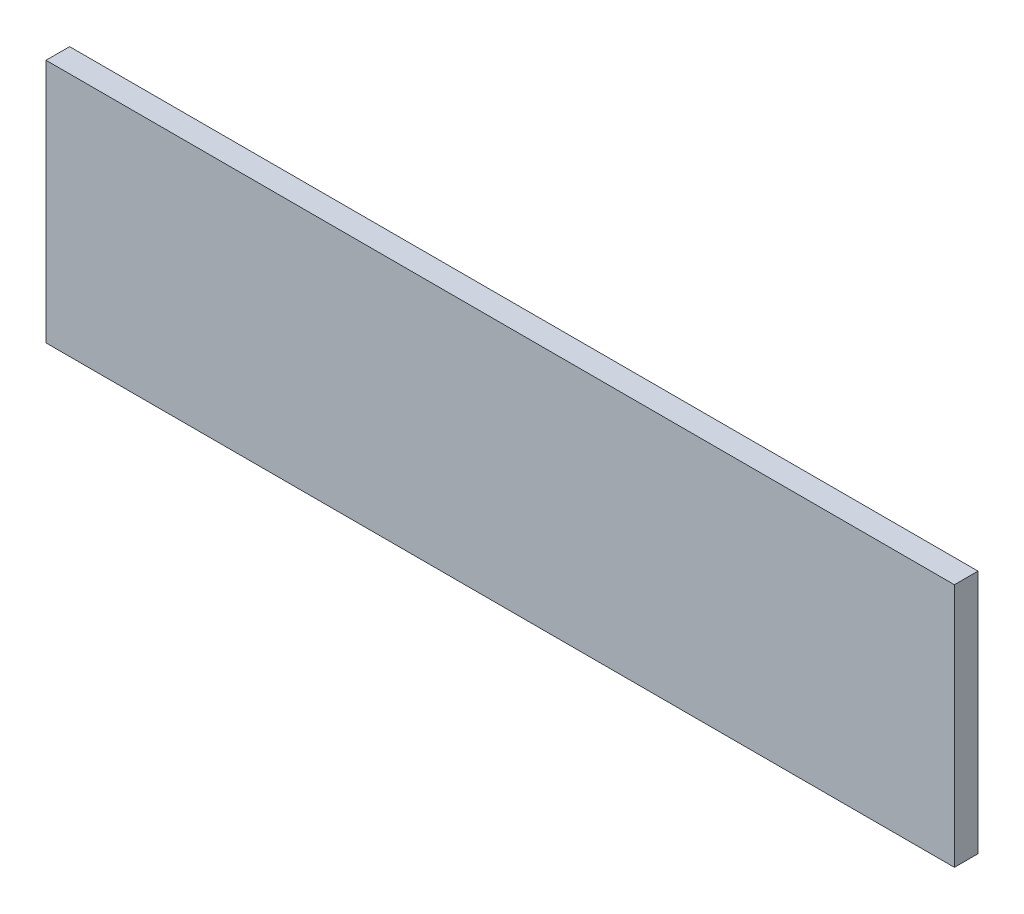
ISO-10303-21;
HEADER;
FILE_DESCRIPTION(('STEP AP214'),'2;1');
FILE_NAME('part.step','',(''),(''),'','','');
FILE_SCHEMA(('AUTOMOTIVE_DESIGN { 1 0 10303 214 1 1 1 1 }'));
ENDSEC;
DATA;
#1=APPLICATION_CONTEXT('core data for automotive mechanical design processes');
#2=APPLICATION_PROTOCOL_DEFINITION('international standard','automotive_design',2000,#1);
#3=PRODUCT_CONTEXT('',#1,'mechanical');
#4=PRODUCT('Part','Part','',(#3));
#5=PRODUCT_RELATED_PRODUCT_CATEGORY('part','',(#4));
#6=PRODUCT_DEFINITION_FORMATION('','',#4);
#7=PRODUCT_DEFINITION_CONTEXT('part definition',#1,'design');
#8=PRODUCT_DEFINITION('design','',#6,#7);
#9=PRODUCT_DEFINITION_SHAPE('','',#8);
#10=(LENGTH_UNIT() NAMED_UNIT(*) SI_UNIT(.MILLI.,.METRE.));
#11=(NAMED_UNIT(*) PLANE_ANGLE_UNIT() SI_UNIT($,.RADIAN.));
#12=(NAMED_UNIT(*) SI_UNIT($,.STERADIAN.) SOLID_ANGLE_UNIT());
#13=UNCERTAINTY_MEASURE_WITH_UNIT(LENGTH_MEASURE(1.E-05),#10,'distance_accuracy_value','');
#14=(GEOMETRIC_REPRESENTATION_CONTEXT(3) GLOBAL_UNCERTAINTY_ASSIGNED_CONTEXT((#13)) GLOBAL_UNIT_ASSIGNED_CONTEXT((#10,
#11,#12)) REPRESENTATION_CONTEXT('',''));
#15=CARTESIAN_POINT('',(0.,0.,0.));
#16=DIRECTION('',(0.,0.,1.));
#17=DIRECTION('',(1.,0.,0.));
#18=AXIS2_PLACEMENT_3D('',#15,#16,#17);
#19=CARTESIAN_POINT('',(0.,0.,-8.));
#20=DIRECTION('',(-1.,0.,0.));
#21=DIRECTION('',(0.,0.,1.));
#22=AXIS2_PLACEMENT_3D('',#19,#20,#21);
#23=PLANE('',#22);
#24=DIRECTION('',(0.,-1.,0.));
#25=VECTOR('',#24,1.);
#26=CARTESIAN_POINT('',(0.,0.,0.));
#27=LINE('',#26,#25);
#28=CARTESIAN_POINT('',(0.,83.,0.));
#29=VERTEX_POINT('',#28);
#30=CARTESIAN_POINT('',(0.,0.,0.));
#31=VERTEX_POINT('',#30);
#32=EDGE_CURVE('E73',#29,#31,#27,.T.);
#33=ORIENTED_EDGE('',*,*,#32,.F.);
#34=DIRECTION('',(0.,0.,1.));
#35=VECTOR('',#34,1.);
#36=CARTESIAN_POINT('',(0.,83.,-8.));
#37=LINE('',#36,#35);
#38=CARTESIAN_POINT('',(0.,83.,-8.));
#39=VERTEX_POINT('',#38);
#40=EDGE_CURVE('E11',#39,#29,#37,.T.);
#41=ORIENTED_EDGE('',*,*,#40,.F.);
#42=DIRECTION('',(0.,-1.,0.));
#43=VECTOR('',#42,1.);
#44=CARTESIAN_POINT('',(0.,0.,-8.));
#45=LINE('',#44,#43);
#46=CARTESIAN_POINT('',(0.,0.,-8.));
#47=VERTEX_POINT('',#46);
#48=EDGE_CURVE('E75',#39,#47,#45,.T.);
#49=ORIENTED_EDGE('',*,*,#48,.T.);
#50=DIRECTION('',(0.,0.,1.));
#51=VECTOR('',#50,1.);
#52=CARTESIAN_POINT('',(0.,0.,-8.));
#53=LINE('',#52,#51);
#54=EDGE_CURVE('E36',#47,#31,#53,.T.);
#55=ORIENTED_EDGE('',*,*,#54,.T.);
#56=EDGE_LOOP('',(#33,#41,#49,#55));
#57=FACE_BOUND('',#56,.T.);
#58=ADVANCED_FACE('F33',(#57),#23,.T.);
#59=CARTESIAN_POINT('',(0.,83.,-8.));
#60=DIRECTION('',(0.,1.,0.));
#61=DIRECTION('',(0.,0.,1.));
#62=AXIS2_PLACEMENT_3D('',#59,#60,#61);
#63=PLANE('',#62);
#64=DIRECTION('',(-1.,0.,0.));
#65=VECTOR('',#64,1.);
#66=CARTESIAN_POINT('',(0.,83.,0.));
#67=LINE('',#66,#65);
#68=CARTESIAN_POINT('',(308.,83.,0.));
#69=VERTEX_POINT('',#68);
#70=EDGE_CURVE('E90',#69,#29,#67,.T.);
#71=ORIENTED_EDGE('',*,*,#70,.F.);
#72=DIRECTION('',(0.,0.,1.));
#73=VECTOR('',#72,1.);
#74=CARTESIAN_POINT('',(308.,83.,-8.));
#75=LINE('',#74,#73);
#76=CARTESIAN_POINT('',(308.,83.,-8.));
#77=VERTEX_POINT('',#76);
#78=EDGE_CURVE('E41',#77,#69,#75,.T.);
#79=ORIENTED_EDGE('',*,*,#78,.F.);
#80=DIRECTION('',(-1.,0.,0.));
#81=VECTOR('',#80,1.);
#82=CARTESIAN_POINT('',(0.,83.,-8.));
#83=LINE('',#82,#81);
#84=EDGE_CURVE('E80',#77,#39,#83,.T.);
#85=ORIENTED_EDGE('',*,*,#84,.T.);
#86=ORIENTED_EDGE('',*,*,#40,.T.);
#87=EDGE_LOOP('',(#71,#79,#85,#86));
#88=FACE_BOUND('',#87,.T.);
#89=ADVANCED_FACE('F105',(#88),#63,.T.);
#90=CARTESIAN_POINT('',(308.,0.,-8.));
#91=DIRECTION('',(1.,0.,0.));
#92=DIRECTION('',(0.,0.,-1.));
#93=AXIS2_PLACEMENT_3D('',#90,#91,#92);
#94=PLANE('',#93);
#95=DIRECTION('',(0.,1.,0.));
#96=VECTOR('',#95,1.);
#97=CARTESIAN_POINT('',(308.,0.,0.));
#98=LINE('',#97,#96);
#99=CARTESIAN_POINT('',(308.,0.,0.));
#100=VERTEX_POINT('',#99);
#101=EDGE_CURVE('E87',#100,#69,#98,.T.);
#102=ORIENTED_EDGE('',*,*,#101,.F.);
#103=DIRECTION('',(0.,0.,1.));
#104=VECTOR('',#103,1.);
#105=CARTESIAN_POINT('',(308.,0.,-8.));
#106=LINE('',#105,#104);
#107=CARTESIAN_POINT('',(308.,0.,-8.));
#108=VERTEX_POINT('',#107);
#109=EDGE_CURVE('E79',#108,#100,#106,.T.);
#110=ORIENTED_EDGE('',*,*,#109,.F.);
#111=DIRECTION('',(0.,1.,0.));
#112=VECTOR('',#111,1.);
#113=CARTESIAN_POINT('',(308.,0.,-8.));
#114=LINE('',#113,#112);
#115=EDGE_CURVE('E98',#108,#77,#114,.T.);
#116=ORIENTED_EDGE('',*,*,#115,.T.);
#117=ORIENTED_EDGE('',*,*,#78,.T.);
#118=EDGE_LOOP('',(#102,#110,#116,#117));
#119=FACE_BOUND('',#118,.T.);
#120=ADVANCED_FACE('F102',(#119),#94,.T.);
#121=CARTESIAN_POINT('',(0.,0.,-8.));
#122=DIRECTION('',(0.,-1.,0.));
#123=DIRECTION('',(0.,0.,-1.));
#124=AXIS2_PLACEMENT_3D('',#121,#122,#123);
#125=PLANE('',#124);
#126=DIRECTION('',(1.,0.,0.));
#127=VECTOR('',#126,1.);
#128=CARTESIAN_POINT('',(0.,0.,0.));
#129=LINE('',#128,#127);
#130=EDGE_CURVE('E82',#31,#100,#129,.T.);
#131=ORIENTED_EDGE('',*,*,#130,.F.);
#132=ORIENTED_EDGE('',*,*,#54,.F.);
#133=DIRECTION('',(1.,0.,0.));
#134=VECTOR('',#133,1.);
#135=CARTESIAN_POINT('',(0.,0.,-8.));
#136=LINE('',#135,#134);
#137=EDGE_CURVE('E96',#47,#108,#136,.T.);
#138=ORIENTED_EDGE('',*,*,#137,.T.);
#139=ORIENTED_EDGE('',*,*,#109,.T.);
#140=EDGE_LOOP('',(#131,#132,#138,#139));
#141=FACE_BOUND('',#140,.T.);
#142=ADVANCED_FACE('F83',(#141),#125,.T.);
#143=CARTESIAN_POINT('',(0.,83.,-8.));
#144=DIRECTION('',(0.,0.,-1.));
#145=DIRECTION('',(-1.,0.,0.));
#146=AXIS2_PLACEMENT_3D('',#143,#144,#145);
#147=PLANE('',#146);
#148=ORIENTED_EDGE('',*,*,#48,.F.);
#149=ORIENTED_EDGE('',*,*,#84,.F.);
#150=ORIENTED_EDGE('',*,*,#115,.F.);
#151=ORIENTED_EDGE('',*,*,#137,.F.);
#152=EDGE_LOOP('',(#148,#149,#150,#151));
#153=FACE_BOUND('',#152,.T.);
#154=ADVANCED_FACE('F107',(#153),#147,.T.);
#155=CARTESIAN_POINT('',(0.,83.,0.));
#156=DIRECTION('',(0.,0.,-1.));
#157=DIRECTION('',(-1.,0.,0.));
#158=AXIS2_PLACEMENT_3D('',#155,#156,#157);
#159=PLANE('',#158);
#160=ORIENTED_EDGE('',*,*,#32,.T.);
#161=ORIENTED_EDGE('',*,*,#130,.T.);
#162=ORIENTED_EDGE('',*,*,#101,.T.);
#163=ORIENTED_EDGE('',*,*,#70,.T.);
#164=EDGE_LOOP('',(#160,#161,#162,#163));
#165=FACE_BOUND('',#164,.T.);
#166=ADVANCED_FACE('F89',(#165),#159,.F.);
#167=CLOSED_SHELL('',(#58,#89,#120,#142,#154,#166));
#168=MANIFOLD_SOLID_BREP('B2',#167);
#169=ADVANCED_BREP_SHAPE_REPRESENTATION('',(#18,#168),#14);
#170=SHAPE_DEFINITION_REPRESENTATION(#9,#169);
ENDSEC;
END-ISO-10303-21;
